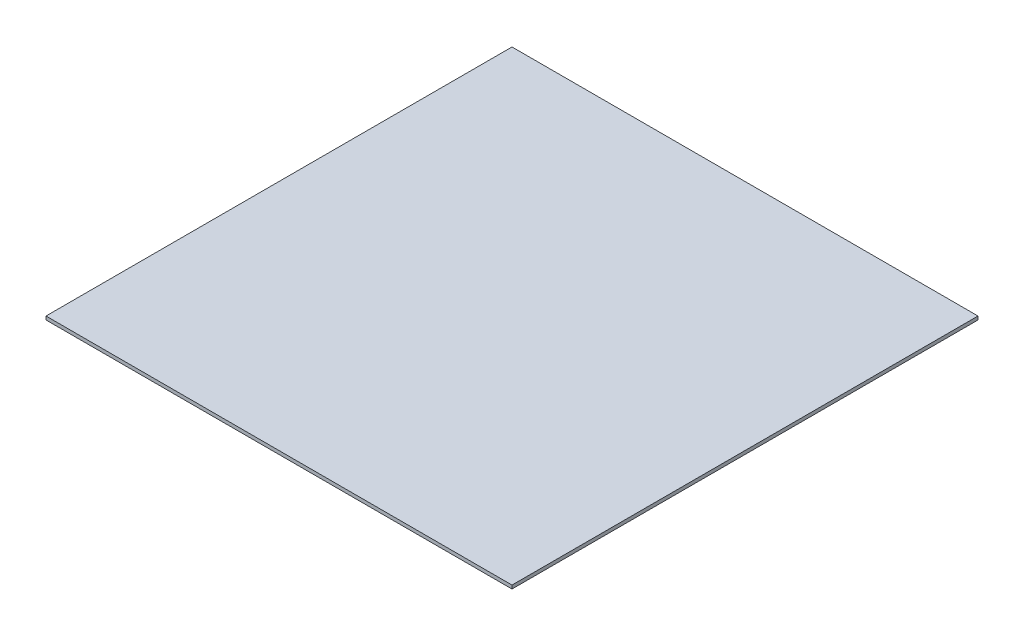
ISO-10303-21;
HEADER;
FILE_DESCRIPTION(('STEP AP214'),'2;1');
FILE_NAME('part.step','',(''),(''),'','','');
FILE_SCHEMA(('AUTOMOTIVE_DESIGN { 1 0 10303 214 1 1 1 1 }'));
ENDSEC;
DATA;
#1=APPLICATION_CONTEXT('core data for automotive mechanical design processes');
#2=APPLICATION_PROTOCOL_DEFINITION('international standard','automotive_design',2000,#1);
#3=PRODUCT_CONTEXT('',#1,'mechanical');
#4=PRODUCT('Part','Part','',(#3));
#5=PRODUCT_RELATED_PRODUCT_CATEGORY('part','',(#4));
#6=PRODUCT_DEFINITION_FORMATION('','',#4);
#7=PRODUCT_DEFINITION_CONTEXT('part definition',#1,'design');
#8=PRODUCT_DEFINITION('design','',#6,#7);
#9=PRODUCT_DEFINITION_SHAPE('','',#8);
#10=(LENGTH_UNIT() NAMED_UNIT(*) SI_UNIT(.MILLI.,.METRE.));
#11=(NAMED_UNIT(*) PLANE_ANGLE_UNIT() SI_UNIT($,.RADIAN.));
#12=(NAMED_UNIT(*) SI_UNIT($,.STERADIAN.) SOLID_ANGLE_UNIT());
#13=UNCERTAINTY_MEASURE_WITH_UNIT(LENGTH_MEASURE(1.E-05),#10,'distance_accuracy_value','');
#14=(GEOMETRIC_REPRESENTATION_CONTEXT(3) GLOBAL_UNCERTAINTY_ASSIGNED_CONTEXT((#13)) GLOBAL_UNIT_ASSIGNED_CONTEXT((#10,
#11,#12)) REPRESENTATION_CONTEXT('',''));
#15=CARTESIAN_POINT('',(0.,0.,0.));
#16=DIRECTION('',(0.,0.,1.));
#17=DIRECTION('',(1.,0.,0.));
#18=AXIS2_PLACEMENT_3D('',#15,#16,#17);
#19=CARTESIAN_POINT('',(257.175,3.82,-257.175));
#20=DIRECTION('',(-1.,0.,0.));
#21=DIRECTION('',(0.,0.,1.));
#22=AXIS2_PLACEMENT_3D('',#19,#20,#21);
#23=PLANE('',#22);
#24=DIRECTION('',(0.,0.,-1.));
#25=VECTOR('',#24,1.);
#26=CARTESIAN_POINT('',(257.175,0.,-257.175));
#27=LINE('',#26,#25);
#28=CARTESIAN_POINT('',(257.175,0.,257.175));
#29=VERTEX_POINT('',#28);
#30=CARTESIAN_POINT('',(257.175,0.,-257.175));
#31=VERTEX_POINT('',#30);
#32=EDGE_CURVE('E97',#29,#31,#27,.T.);
#33=ORIENTED_EDGE('',*,*,#32,.T.);
#34=DIRECTION('',(0.,-1.,0.));
#35=VECTOR('',#34,1.);
#36=CARTESIAN_POINT('',(257.175,3.82,-257.175));
#37=LINE('',#36,#35);
#38=CARTESIAN_POINT('',(257.175,3.82,-257.175));
#39=VERTEX_POINT('',#38);
#40=EDGE_CURVE('E11',#39,#31,#37,.T.);
#41=ORIENTED_EDGE('',*,*,#40,.F.);
#42=DIRECTION('',(0.,0.,-1.));
#43=VECTOR('',#42,1.);
#44=CARTESIAN_POINT('',(257.175,3.82,-257.175));
#45=LINE('',#44,#43);
#46=CARTESIAN_POINT('',(257.175,3.82,257.175));
#47=VERTEX_POINT('',#46);
#48=EDGE_CURVE('E85',#47,#39,#45,.T.);
#49=ORIENTED_EDGE('',*,*,#48,.F.);
#50=DIRECTION('',(0.,-1.,0.));
#51=VECTOR('',#50,1.);
#52=CARTESIAN_POINT('',(257.175,3.82,257.175));
#53=LINE('',#52,#51);
#54=EDGE_CURVE('E93',#47,#29,#53,.T.);
#55=ORIENTED_EDGE('',*,*,#54,.T.);
#56=EDGE_LOOP('',(#33,#41,#49,#55));
#57=FACE_BOUND('',#56,.T.);
#58=ADVANCED_FACE('F34',(#57),#23,.F.);
#59=CARTESIAN_POINT('',(-257.175,3.82,-257.175));
#60=DIRECTION('',(0.,0.,1.));
#61=DIRECTION('',(1.,0.,0.));
#62=AXIS2_PLACEMENT_3D('',#59,#60,#61);
#63=PLANE('',#62);
#64=DIRECTION('',(-1.,0.,0.));
#65=VECTOR('',#64,1.);
#66=CARTESIAN_POINT('',(-257.175,0.,-257.175));
#67=LINE('',#66,#65);
#68=CARTESIAN_POINT('',(-257.175,0.,-257.175));
#69=VERTEX_POINT('',#68);
#70=EDGE_CURVE('E89',#31,#69,#67,.T.);
#71=ORIENTED_EDGE('',*,*,#70,.T.);
#72=DIRECTION('',(0.,-1.,0.));
#73=VECTOR('',#72,1.);
#74=CARTESIAN_POINT('',(-257.175,3.82,-257.175));
#75=LINE('',#74,#73);
#76=CARTESIAN_POINT('',(-257.175,3.82,-257.175));
#77=VERTEX_POINT('',#76);
#78=EDGE_CURVE('E42',#77,#69,#75,.T.);
#79=ORIENTED_EDGE('',*,*,#78,.F.);
#80=DIRECTION('',(-1.,0.,0.));
#81=VECTOR('',#80,1.);
#82=CARTESIAN_POINT('',(-257.175,3.82,-257.175));
#83=LINE('',#82,#81);
#84=EDGE_CURVE('E80',#39,#77,#83,.T.);
#85=ORIENTED_EDGE('',*,*,#84,.F.);
#86=ORIENTED_EDGE('',*,*,#40,.T.);
#87=EDGE_LOOP('',(#71,#79,#85,#86));
#88=FACE_BOUND('',#87,.T.);
#89=ADVANCED_FACE('F88',(#88),#63,.F.);
#90=CARTESIAN_POINT('',(-257.175,3.82,-257.175));
#91=DIRECTION('',(1.,0.,0.));
#92=DIRECTION('',(0.,0.,-1.));
#93=AXIS2_PLACEMENT_3D('',#90,#91,#92);
#94=PLANE('',#93);
#95=DIRECTION('',(0.,0.,1.));
#96=VECTOR('',#95,1.);
#97=CARTESIAN_POINT('',(-257.175,0.,-257.175));
#98=LINE('',#97,#96);
#99=CARTESIAN_POINT('',(-257.175,0.,257.175));
#100=VERTEX_POINT('',#99);
#101=EDGE_CURVE('E67',#69,#100,#98,.T.);
#102=ORIENTED_EDGE('',*,*,#101,.T.);
#103=DIRECTION('',(0.,-1.,0.));
#104=VECTOR('',#103,1.);
#105=CARTESIAN_POINT('',(-257.175,3.82,257.175));
#106=LINE('',#105,#104);
#107=CARTESIAN_POINT('',(-257.175,3.82,257.175));
#108=VERTEX_POINT('',#107);
#109=EDGE_CURVE('E90',#108,#100,#106,.T.);
#110=ORIENTED_EDGE('',*,*,#109,.F.);
#111=DIRECTION('',(0.,0.,1.));
#112=VECTOR('',#111,1.);
#113=CARTESIAN_POINT('',(-257.175,3.82,-257.175));
#114=LINE('',#113,#112);
#115=EDGE_CURVE('E83',#77,#108,#114,.T.);
#116=ORIENTED_EDGE('',*,*,#115,.F.);
#117=ORIENTED_EDGE('',*,*,#78,.T.);
#118=EDGE_LOOP('',(#102,#110,#116,#117));
#119=FACE_BOUND('',#118,.T.);
#120=ADVANCED_FACE('F91',(#119),#94,.F.);
#121=CARTESIAN_POINT('',(-257.175,3.82,257.175));
#122=DIRECTION('',(0.,0.,-1.));
#123=DIRECTION('',(-1.,0.,0.));
#124=AXIS2_PLACEMENT_3D('',#121,#122,#123);
#125=PLANE('',#124);
#126=DIRECTION('',(1.,0.,0.));
#127=VECTOR('',#126,1.);
#128=CARTESIAN_POINT('',(-257.175,0.,257.175));
#129=LINE('',#128,#127);
#130=EDGE_CURVE('E73',#100,#29,#129,.T.);
#131=ORIENTED_EDGE('',*,*,#130,.T.);
#132=ORIENTED_EDGE('',*,*,#54,.F.);
#133=DIRECTION('',(1.,0.,0.));
#134=VECTOR('',#133,1.);
#135=CARTESIAN_POINT('',(-257.175,3.82,257.175));
#136=LINE('',#135,#134);
#137=EDGE_CURVE('E50',#108,#47,#136,.T.);
#138=ORIENTED_EDGE('',*,*,#137,.F.);
#139=ORIENTED_EDGE('',*,*,#109,.T.);
#140=EDGE_LOOP('',(#131,#132,#138,#139));
#141=FACE_BOUND('',#140,.T.);
#142=ADVANCED_FACE('F104',(#141),#125,.F.);
#143=CARTESIAN_POINT('',(0.,3.82,0.));
#144=DIRECTION('',(0.,1.,0.));
#145=DIRECTION('',(0.,0.,1.));
#146=AXIS2_PLACEMENT_3D('',#143,#144,#145);
#147=PLANE('',#146);
#148=ORIENTED_EDGE('',*,*,#48,.T.);
#149=ORIENTED_EDGE('',*,*,#84,.T.);
#150=ORIENTED_EDGE('',*,*,#115,.T.);
#151=ORIENTED_EDGE('',*,*,#137,.T.);
#152=EDGE_LOOP('',(#148,#149,#150,#151));
#153=FACE_BOUND('',#152,.T.);
#154=ADVANCED_FACE('F81',(#153),#147,.T.);
#155=CARTESIAN_POINT('',(0.,0.,0.));
#156=DIRECTION('',(0.,1.,0.));
#157=DIRECTION('',(0.,0.,1.));
#158=AXIS2_PLACEMENT_3D('',#155,#156,#157);
#159=PLANE('',#158);
#160=ORIENTED_EDGE('',*,*,#32,.F.);
#161=ORIENTED_EDGE('',*,*,#130,.F.);
#162=ORIENTED_EDGE('',*,*,#101,.F.);
#163=ORIENTED_EDGE('',*,*,#70,.F.);
#164=EDGE_LOOP('',(#160,#161,#162,#163));
#165=FACE_BOUND('',#164,.T.);
#166=ADVANCED_FACE('F107',(#165),#159,.F.);
#167=CLOSED_SHELL('',(#58,#89,#120,#142,#154,#166));
#168=MANIFOLD_SOLID_BREP('B2',#167);
#169=ADVANCED_BREP_SHAPE_REPRESENTATION('',(#18,#168),#14);
#170=SHAPE_DEFINITION_REPRESENTATION(#9,#169);
ENDSEC;
END-ISO-10303-21;
